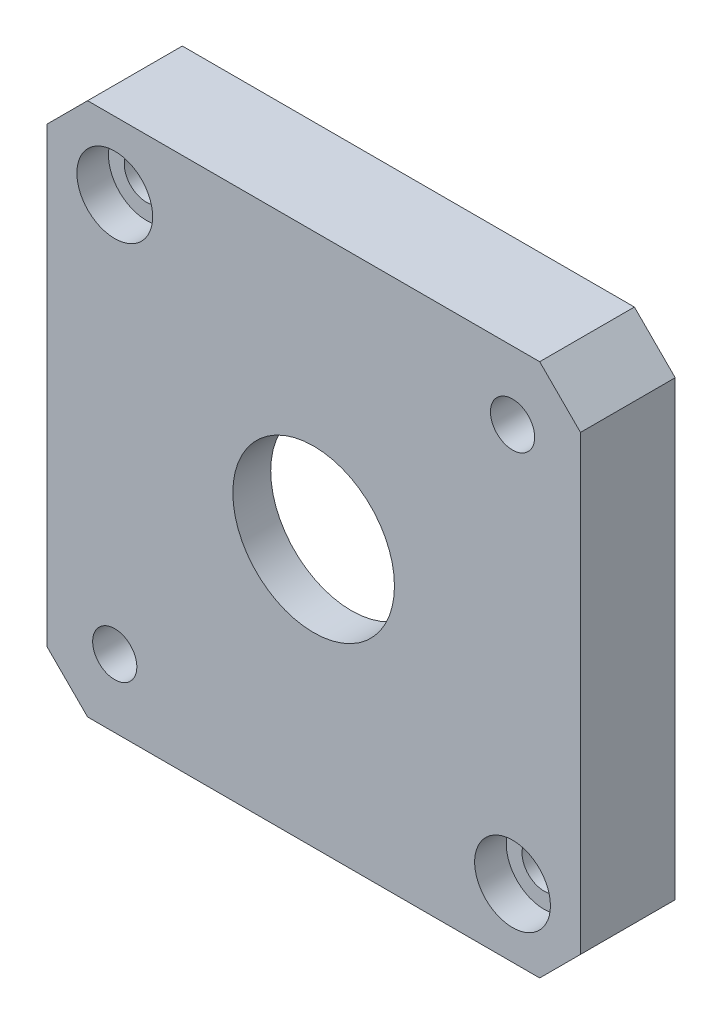
ISO-10303-21;
HEADER;
FILE_DESCRIPTION(('STEP AP214'),'2;1');
FILE_NAME('part.step','',(''),(''),'','','');
FILE_SCHEMA(('AUTOMOTIVE_DESIGN { 1 0 10303 214 1 1 1 1 }'));
ENDSEC;
DATA;
#1=APPLICATION_CONTEXT('core data for automotive mechanical design processes');
#2=APPLICATION_PROTOCOL_DEFINITION('international standard','automotive_design',2000,#1);
#3=PRODUCT_CONTEXT('',#1,'mechanical');
#4=PRODUCT('Part','Part','',(#3));
#5=PRODUCT_RELATED_PRODUCT_CATEGORY('part','',(#4));
#6=PRODUCT_DEFINITION_FORMATION('','',#4);
#7=PRODUCT_DEFINITION_CONTEXT('part definition',#1,'design');
#8=PRODUCT_DEFINITION('design','',#6,#7);
#9=PRODUCT_DEFINITION_SHAPE('','',#8);
#10=(LENGTH_UNIT() NAMED_UNIT(*) SI_UNIT(.MILLI.,.METRE.));
#11=(NAMED_UNIT(*) PLANE_ANGLE_UNIT() SI_UNIT($,.RADIAN.));
#12=(NAMED_UNIT(*) SI_UNIT($,.STERADIAN.) SOLID_ANGLE_UNIT());
#13=UNCERTAINTY_MEASURE_WITH_UNIT(LENGTH_MEASURE(1.E-05),#10,'distance_accuracy_value','');
#14=(GEOMETRIC_REPRESENTATION_CONTEXT(3) GLOBAL_UNCERTAINTY_ASSIGNED_CONTEXT((#13)) GLOBAL_UNIT_ASSIGNED_CONTEXT((#10,
#11,#12)) REPRESENTATION_CONTEXT('',''));
#15=CARTESIAN_POINT('',(0.,0.,0.));
#16=DIRECTION('',(0.,0.,1.));
#17=DIRECTION('',(1.,0.,0.));
#18=AXIS2_PLACEMENT_3D('',#15,#16,#17);
#19=CARTESIAN_POINT('',(-6.94516928509075,15.4665624778803,4.5));
#20=DIRECTION('',(0.,0.,-1.));
#21=DIRECTION('',(-1.,0.,0.));
#22=AXIS2_PLACEMENT_3D('',#19,#20,#21);
#23=CYLINDRICAL_SURFACE('',#22,1.75);
#24=CARTESIAN_POINT('',(-6.94516928509075,15.4665624778803,0.));
#25=DIRECTION('',(0.,0.,1.));
#26=DIRECTION('',(1.,0.,0.));
#27=AXIS2_PLACEMENT_3D('',#24,#25,#26);
#28=CIRCLE('',#27,1.75);
#29=CARTESIAN_POINT('',(-5.19516928509074,15.4665624778803,0.));
#30=VERTEX_POINT('',#29);
#31=EDGE_CURVE('E155',#30,#30,#28,.T.);
#32=ORIENTED_EDGE('',*,*,#31,.F.);
#33=EDGE_LOOP('',(#32));
#34=FACE_BOUND('',#33,.T.);
#35=CARTESIAN_POINT('',(-6.94516928509075,15.4665624778803,5.));
#36=DIRECTION('',(0.,0.,1.));
#37=DIRECTION('',(1.,0.,0.));
#38=AXIS2_PLACEMENT_3D('',#35,#36,#37);
#39=CIRCLE('',#38,1.75);
#40=CARTESIAN_POINT('',(-5.19516928509074,15.4665624778803,5.));
#41=VERTEX_POINT('',#40);
#42=EDGE_CURVE('E37',#41,#41,#39,.T.);
#43=ORIENTED_EDGE('',*,*,#42,.T.);
#44=EDGE_LOOP('',(#43));
#45=FACE_BOUND('',#44,.T.);
#46=ADVANCED_FACE('F33',(#34,#45),#23,.F.);
#47=CARTESIAN_POINT('',(24.5548307149093,-16.0334375221197,4.5));
#48=DIRECTION('',(0.,0.,-1.));
#49=DIRECTION('',(-1.,0.,0.));
#50=AXIS2_PLACEMENT_3D('',#47,#48,#49);
#51=CYLINDRICAL_SURFACE('',#50,1.74999999999999);
#52=CARTESIAN_POINT('',(24.5548307149093,-16.0334375221197,0.));
#53=DIRECTION('',(0.,0.,1.));
#54=DIRECTION('',(1.,0.,0.));
#55=AXIS2_PLACEMENT_3D('',#52,#53,#54);
#56=CIRCLE('',#55,1.74999999999999);
#57=CARTESIAN_POINT('',(26.3048307149092,-16.0334375221197,0.));
#58=VERTEX_POINT('',#57);
#59=EDGE_CURVE('E149',#58,#58,#56,.T.);
#60=ORIENTED_EDGE('',*,*,#59,.F.);
#61=EDGE_LOOP('',(#60));
#62=FACE_BOUND('',#61,.T.);
#63=CARTESIAN_POINT('',(24.5548307149093,-16.0334375221197,5.));
#64=DIRECTION('',(0.,0.,1.));
#65=DIRECTION('',(1.,0.,0.));
#66=AXIS2_PLACEMENT_3D('',#63,#64,#65);
#67=CIRCLE('',#66,1.74999999999999);
#68=CARTESIAN_POINT('',(26.3048307149092,-16.0334375221197,5.));
#69=VERTEX_POINT('',#68);
#70=EDGE_CURVE('E189',#69,#69,#67,.T.);
#71=ORIENTED_EDGE('',*,*,#70,.T.);
#72=EDGE_LOOP('',(#71));
#73=FACE_BOUND('',#72,.T.);
#74=ADVANCED_FACE('F237',(#62,#73),#51,.F.);
#75=CARTESIAN_POINT('',(0.,0.,0.));
#76=DIRECTION('',(0.,0.,1.));
#77=DIRECTION('',(1.,0.,0.));
#78=AXIS2_PLACEMENT_3D('',#75,#76,#77);
#79=PLANE('',#78);
#80=DIRECTION('',(-0.707106781186548,-0.707106781186548,0.));
#81=VECTOR('',#80,1.);
#82=CARTESIAN_POINT('',(-9.09516928509077,20.8488567993777,0.));
#83=LINE('',#82,#81);
#84=CARTESIAN_POINT('',(-9.09516928509077,20.8488567993777,0.));
#85=VERTEX_POINT('',#84);
#86=CARTESIAN_POINT('',(-12.3274636065882,17.6165624778803,0.));
#87=VERTEX_POINT('',#86);
#88=EDGE_CURVE('E163',#85,#87,#83,.T.);
#89=ORIENTED_EDGE('',*,*,#88,.F.);
#90=DIRECTION('',(-1.,0.,0.));
#91=VECTOR('',#90,1.);
#92=CARTESIAN_POINT('',(26.7048307149092,20.8488567993777,0.));
#93=LINE('',#92,#91);
#94=CARTESIAN_POINT('',(26.7048307149092,20.8488567993777,0.));
#95=VERTEX_POINT('',#94);
#96=EDGE_CURVE('E50',#95,#85,#93,.T.);
#97=ORIENTED_EDGE('',*,*,#96,.F.);
#98=DIRECTION('',(-0.707106781186548,0.707106781186547,0.));
#99=VECTOR('',#98,1.);
#100=CARTESIAN_POINT('',(29.9371250364067,17.6165624778803,0.));
#101=LINE('',#100,#99);
#102=CARTESIAN_POINT('',(29.9371250364067,17.6165624778803,0.));
#103=VERTEX_POINT('',#102);
#104=EDGE_CURVE('E58',#103,#95,#101,.T.);
#105=ORIENTED_EDGE('',*,*,#104,.F.);
#106=DIRECTION('',(0.,1.,0.));
#107=VECTOR('',#106,1.);
#108=CARTESIAN_POINT('',(29.9371250364067,-18.1834375221197,0.));
#109=LINE('',#108,#107);
#110=CARTESIAN_POINT('',(29.9371250364067,-18.1834375221197,0.));
#111=VERTEX_POINT('',#110);
#112=EDGE_CURVE('E173',#111,#103,#109,.T.);
#113=ORIENTED_EDGE('',*,*,#112,.F.);
#114=DIRECTION('',(0.707106781186547,0.707106781186547,0.));
#115=VECTOR('',#114,1.);
#116=CARTESIAN_POINT('',(26.7048307149092,-21.4157318436171,0.));
#117=LINE('',#116,#115);
#118=CARTESIAN_POINT('',(26.7048307149092,-21.4157318436171,0.));
#119=VERTEX_POINT('',#118);
#120=EDGE_CURVE('E171',#119,#111,#117,.T.);
#121=ORIENTED_EDGE('',*,*,#120,.F.);
#122=DIRECTION('',(1.,0.,0.));
#123=VECTOR('',#122,1.);
#124=CARTESIAN_POINT('',(-9.09516928509078,-21.4157318436171,0.));
#125=LINE('',#124,#123);
#126=CARTESIAN_POINT('',(-9.09516928509078,-21.4157318436171,0.));
#127=VERTEX_POINT('',#126);
#128=EDGE_CURVE('E169',#127,#119,#125,.T.);
#129=ORIENTED_EDGE('',*,*,#128,.F.);
#130=DIRECTION('',(0.707106781186547,-0.707106781186547,0.));
#131=VECTOR('',#130,1.);
#132=CARTESIAN_POINT('',(-12.3274636065882,-18.1834375221197,0.));
#133=LINE('',#132,#131);
#134=CARTESIAN_POINT('',(-12.3274636065882,-18.1834375221197,0.));
#135=VERTEX_POINT('',#134);
#136=EDGE_CURVE('E167',#135,#127,#133,.T.);
#137=ORIENTED_EDGE('',*,*,#136,.F.);
#138=DIRECTION('',(0.,-1.,0.));
#139=VECTOR('',#138,1.);
#140=CARTESIAN_POINT('',(-12.3274636065882,17.6165624778803,0.));
#141=LINE('',#140,#139);
#142=EDGE_CURVE('E105',#87,#135,#141,.T.);
#143=ORIENTED_EDGE('',*,*,#142,.F.);
#144=EDGE_LOOP('',(#89,#97,#105,#113,#121,#129,#137,#143));
#145=FACE_BOUND('',#144,.T.);
#146=CARTESIAN_POINT('',(8.80483071490925,-0.283437522119711,0.));
#147=DIRECTION('',(0.,0.,1.));
#148=DIRECTION('',(1.,0.,0.));
#149=AXIS2_PLACEMENT_3D('',#146,#147,#148);
#150=CIRCLE('',#149,18.5);
#151=CARTESIAN_POINT('',(27.3048307149093,-0.283437522119711,0.));
#152=VERTEX_POINT('',#151);
#153=EDGE_CURVE('E158',#152,#152,#150,.T.);
#154=ORIENTED_EDGE('',*,*,#153,.T.);
#155=EDGE_LOOP('',(#154));
#156=FACE_BOUND('',#155,.T.);
#157=ORIENTED_EDGE('',*,*,#31,.T.);
#158=EDGE_LOOP('',(#157));
#159=FACE_BOUND('',#158,.T.);
#160=CARTESIAN_POINT('',(-6.94516928509075,-16.0334375221197,0.));
#161=DIRECTION('',(0.,0.,1.));
#162=DIRECTION('',(1.,0.,0.));
#163=AXIS2_PLACEMENT_3D('',#160,#161,#162);
#164=CIRCLE('',#163,1.75);
#165=CARTESIAN_POINT('',(-5.19516928509074,-16.0334375221197,0.));
#166=VERTEX_POINT('',#165);
#167=EDGE_CURVE('E152',#166,#166,#164,.T.);
#168=ORIENTED_EDGE('',*,*,#167,.T.);
#169=EDGE_LOOP('',(#168));
#170=FACE_BOUND('',#169,.T.);
#171=ORIENTED_EDGE('',*,*,#59,.T.);
#172=EDGE_LOOP('',(#171));
#173=FACE_BOUND('',#172,.T.);
#174=CARTESIAN_POINT('',(24.5548307149093,15.4665624778803,0.));
#175=DIRECTION('',(0.,0.,1.));
#176=DIRECTION('',(1.,0.,0.));
#177=AXIS2_PLACEMENT_3D('',#174,#175,#176);
#178=CIRCLE('',#177,1.75000000000075);
#179=CARTESIAN_POINT('',(26.30483071491,15.4665624778803,0.));
#180=VERTEX_POINT('',#179);
#181=EDGE_CURVE('E146',#180,#180,#178,.T.);
#182=ORIENTED_EDGE('',*,*,#181,.T.);
#183=EDGE_LOOP('',(#182));
#184=FACE_BOUND('',#183,.T.);
#185=ADVANCED_FACE('F243',(#145,#156,#159,#170,#173,#184),#79,.F.);
#186=CARTESIAN_POINT('',(-9.09516928509077,20.8488567993777,4.5));
#187=DIRECTION('',(0.707106781186548,-0.707106781186548,0.));
#188=DIRECTION('',(0.707106781186548,0.707106781186548,0.));
#189=AXIS2_PLACEMENT_3D('',#186,#187,#188);
#190=PLANE('',#189);
#191=ORIENTED_EDGE('',*,*,#88,.T.);
#192=DIRECTION('',(0.,0.,-1.));
#193=VECTOR('',#192,1.);
#194=CARTESIAN_POINT('',(-12.3274636065882,17.6165624778803,4.5));
#195=LINE('',#194,#193);
#196=CARTESIAN_POINT('',(-12.3274636065882,17.6165624778803,7.5));
#197=VERTEX_POINT('',#196);
#198=EDGE_CURVE('E11',#197,#87,#195,.T.);
#199=ORIENTED_EDGE('',*,*,#198,.F.);
#200=DIRECTION('',(-0.707106781186548,-0.707106781186548,0.));
#201=VECTOR('',#200,1.);
#202=CARTESIAN_POINT('',(-12.3274636065882,17.6165624778803,7.5));
#203=LINE('',#202,#201);
#204=CARTESIAN_POINT('',(-9.09516928509077,20.8488567993777,7.5));
#205=VERTEX_POINT('',#204);
#206=EDGE_CURVE('E124',#205,#197,#203,.T.);
#207=ORIENTED_EDGE('',*,*,#206,.F.);
#208=DIRECTION('',(0.,0.,-1.));
#209=VECTOR('',#208,1.);
#210=CARTESIAN_POINT('',(-9.09516928509077,20.8488567993777,4.5));
#211=LINE('',#210,#209);
#212=EDGE_CURVE('E177',#205,#85,#211,.T.);
#213=ORIENTED_EDGE('',*,*,#212,.T.);
#214=EDGE_LOOP('',(#191,#199,#207,#213));
#215=FACE_BOUND('',#214,.T.);
#216=ADVANCED_FACE('F35',(#215),#190,.F.);
#217=CARTESIAN_POINT('',(-12.3274636065882,17.6165624778803,4.5));
#218=DIRECTION('',(1.,0.,0.));
#219=DIRECTION('',(0.,0.,-1.));
#220=AXIS2_PLACEMENT_3D('',#217,#218,#219);
#221=PLANE('',#220);
#222=ORIENTED_EDGE('',*,*,#142,.T.);
#223=DIRECTION('',(0.,0.,-1.));
#224=VECTOR('',#223,1.);
#225=CARTESIAN_POINT('',(-12.3274636065882,-18.1834375221197,4.5));
#226=LINE('',#225,#224);
#227=CARTESIAN_POINT('',(-12.3274636065882,-18.1834375221197,7.5));
#228=VERTEX_POINT('',#227);
#229=EDGE_CURVE('E42',#228,#135,#226,.T.);
#230=ORIENTED_EDGE('',*,*,#229,.F.);
#231=DIRECTION('',(0.,-1.,0.));
#232=VECTOR('',#231,1.);
#233=CARTESIAN_POINT('',(-12.3274636065882,-18.1834375221197,7.5));
#234=LINE('',#233,#232);
#235=EDGE_CURVE('E104',#197,#228,#234,.T.);
#236=ORIENTED_EDGE('',*,*,#235,.F.);
#237=ORIENTED_EDGE('',*,*,#198,.T.);
#238=EDGE_LOOP('',(#222,#230,#236,#237));
#239=FACE_BOUND('',#238,.T.);
#240=ADVANCED_FACE('F102',(#239),#221,.F.);
#241=CARTESIAN_POINT('',(-12.3274636065882,-18.1834375221197,4.5));
#242=DIRECTION('',(0.707106781186547,0.707106781186547,0.));
#243=DIRECTION('',(-0.707106781186548,0.707106781186548,0.));
#244=AXIS2_PLACEMENT_3D('',#241,#242,#243);
#245=PLANE('',#244);
#246=ORIENTED_EDGE('',*,*,#136,.T.);
#247=DIRECTION('',(0.,0.,-1.));
#248=VECTOR('',#247,1.);
#249=CARTESIAN_POINT('',(-9.09516928509078,-21.4157318436171,4.5));
#250=LINE('',#249,#248);
#251=CARTESIAN_POINT('',(-9.09516928509078,-21.4157318436171,7.5));
#252=VERTEX_POINT('',#251);
#253=EDGE_CURVE('E108',#252,#127,#250,.T.);
#254=ORIENTED_EDGE('',*,*,#253,.F.);
#255=DIRECTION('',(0.707106781186547,-0.707106781186547,0.));
#256=VECTOR('',#255,1.);
#257=CARTESIAN_POINT('',(-9.09516928509078,-21.4157318436171,7.5));
#258=LINE('',#257,#256);
#259=EDGE_CURVE('E111',#228,#252,#258,.T.);
#260=ORIENTED_EDGE('',*,*,#259,.F.);
#261=ORIENTED_EDGE('',*,*,#229,.T.);
#262=EDGE_LOOP('',(#246,#254,#260,#261));
#263=FACE_BOUND('',#262,.T.);
#264=ADVANCED_FACE('F112',(#263),#245,.F.);
#265=CARTESIAN_POINT('',(-9.09516928509078,-21.4157318436171,4.5));
#266=DIRECTION('',(0.,1.,0.));
#267=DIRECTION('',(0.,0.,1.));
#268=AXIS2_PLACEMENT_3D('',#265,#266,#267);
#269=PLANE('',#268);
#270=ORIENTED_EDGE('',*,*,#128,.T.);
#271=DIRECTION('',(0.,0.,-1.));
#272=VECTOR('',#271,1.);
#273=CARTESIAN_POINT('',(26.7048307149092,-21.4157318436171,4.5));
#274=LINE('',#273,#272);
#275=CARTESIAN_POINT('',(26.7048307149092,-21.4157318436171,7.5));
#276=VERTEX_POINT('',#275);
#277=EDGE_CURVE('E186',#276,#119,#274,.T.);
#278=ORIENTED_EDGE('',*,*,#277,.F.);
#279=DIRECTION('',(1.,0.,0.));
#280=VECTOR('',#279,1.);
#281=CARTESIAN_POINT('',(26.7048307149092,-21.4157318436171,7.5));
#282=LINE('',#281,#280);
#283=EDGE_CURVE('E117',#252,#276,#282,.T.);
#284=ORIENTED_EDGE('',*,*,#283,.F.);
#285=ORIENTED_EDGE('',*,*,#253,.T.);
#286=EDGE_LOOP('',(#270,#278,#284,#285));
#287=FACE_BOUND('',#286,.T.);
#288=ADVANCED_FACE('F271',(#287),#269,.F.);
#289=CARTESIAN_POINT('',(26.7048307149092,-21.4157318436171,4.5));
#290=DIRECTION('',(-0.707106781186547,0.707106781186547,0.));
#291=DIRECTION('',(-0.707106781186548,-0.707106781186548,0.));
#292=AXIS2_PLACEMENT_3D('',#289,#290,#291);
#293=PLANE('',#292);
#294=ORIENTED_EDGE('',*,*,#120,.T.);
#295=DIRECTION('',(0.,0.,-1.));
#296=VECTOR('',#295,1.);
#297=CARTESIAN_POINT('',(29.9371250364067,-18.1834375221197,4.5));
#298=LINE('',#297,#296);
#299=CARTESIAN_POINT('',(29.9371250364067,-18.1834375221197,7.5));
#300=VERTEX_POINT('',#299);
#301=EDGE_CURVE('E183',#300,#111,#298,.T.);
#302=ORIENTED_EDGE('',*,*,#301,.F.);
#303=DIRECTION('',(0.707106781186547,0.707106781186547,0.));
#304=VECTOR('',#303,1.);
#305=CARTESIAN_POINT('',(29.9371250364067,-18.1834375221197,7.5));
#306=LINE('',#305,#304);
#307=EDGE_CURVE('E133',#276,#300,#306,.T.);
#308=ORIENTED_EDGE('',*,*,#307,.F.);
#309=ORIENTED_EDGE('',*,*,#277,.T.);
#310=EDGE_LOOP('',(#294,#302,#308,#309));
#311=FACE_BOUND('',#310,.T.);
#312=ADVANCED_FACE('F267',(#311),#293,.F.);
#313=CARTESIAN_POINT('',(29.9371250364067,-18.1834375221197,4.5));
#314=DIRECTION('',(-1.,0.,0.));
#315=DIRECTION('',(0.,0.,1.));
#316=AXIS2_PLACEMENT_3D('',#313,#314,#315);
#317=PLANE('',#316);
#318=ORIENTED_EDGE('',*,*,#112,.T.);
#319=DIRECTION('',(0.,0.,-1.));
#320=VECTOR('',#319,1.);
#321=CARTESIAN_POINT('',(29.9371250364067,17.6165624778803,4.5));
#322=LINE('',#321,#320);
#323=CARTESIAN_POINT('',(29.9371250364067,17.6165624778803,7.5));
#324=VERTEX_POINT('',#323);
#325=EDGE_CURVE('E181',#324,#103,#322,.T.);
#326=ORIENTED_EDGE('',*,*,#325,.F.);
#327=DIRECTION('',(0.,1.,0.));
#328=VECTOR('',#327,1.);
#329=CARTESIAN_POINT('',(29.9371250364067,17.6165624778803,7.5));
#330=LINE('',#329,#328);
#331=EDGE_CURVE('E136',#300,#324,#330,.T.);
#332=ORIENTED_EDGE('',*,*,#331,.F.);
#333=ORIENTED_EDGE('',*,*,#301,.T.);
#334=EDGE_LOOP('',(#318,#326,#332,#333));
#335=FACE_BOUND('',#334,.T.);
#336=ADVANCED_FACE('F264',(#335),#317,.F.);
#337=CARTESIAN_POINT('',(29.9371250364067,17.6165624778803,4.5));
#338=DIRECTION('',(-0.707106781186547,-0.707106781186548,0.));
#339=DIRECTION('',(0.707106781186548,-0.707106781186547,0.));
#340=AXIS2_PLACEMENT_3D('',#337,#338,#339);
#341=PLANE('',#340);
#342=ORIENTED_EDGE('',*,*,#104,.T.);
#343=DIRECTION('',(0.,0.,-1.));
#344=VECTOR('',#343,1.);
#345=CARTESIAN_POINT('',(26.7048307149092,20.8488567993777,4.5));
#346=LINE('',#345,#344);
#347=CARTESIAN_POINT('',(26.7048307149092,20.8488567993777,7.5));
#348=VERTEX_POINT('',#347);
#349=EDGE_CURVE('E179',#348,#95,#346,.T.);
#350=ORIENTED_EDGE('',*,*,#349,.F.);
#351=DIRECTION('',(-0.707106781186548,0.707106781186547,0.));
#352=VECTOR('',#351,1.);
#353=CARTESIAN_POINT('',(26.7048307149092,20.8488567993777,7.5));
#354=LINE('',#353,#352);
#355=EDGE_CURVE('E139',#324,#348,#354,.T.);
#356=ORIENTED_EDGE('',*,*,#355,.F.);
#357=ORIENTED_EDGE('',*,*,#325,.T.);
#358=EDGE_LOOP('',(#342,#350,#356,#357));
#359=FACE_BOUND('',#358,.T.);
#360=ADVANCED_FACE('F261',(#359),#341,.F.);
#361=CARTESIAN_POINT('',(26.7048307149092,20.8488567993777,4.5));
#362=DIRECTION('',(0.,-1.,0.));
#363=DIRECTION('',(0.,0.,-1.));
#364=AXIS2_PLACEMENT_3D('',#361,#362,#363);
#365=PLANE('',#364);
#366=ORIENTED_EDGE('',*,*,#96,.T.);
#367=ORIENTED_EDGE('',*,*,#212,.F.);
#368=DIRECTION('',(-1.,0.,0.));
#369=VECTOR('',#368,1.);
#370=CARTESIAN_POINT('',(-9.09516928509077,20.8488567993777,7.5));
#371=LINE('',#370,#369);
#372=EDGE_CURVE('E142',#348,#205,#371,.T.);
#373=ORIENTED_EDGE('',*,*,#372,.F.);
#374=ORIENTED_EDGE('',*,*,#349,.T.);
#375=EDGE_LOOP('',(#366,#367,#373,#374));
#376=FACE_BOUND('',#375,.T.);
#377=ADVANCED_FACE('F254',(#376),#365,.F.);
#378=CARTESIAN_POINT('',(8.80483071490925,-0.283437522119711,4.5));
#379=DIRECTION('',(0.,0.,-1.));
#380=DIRECTION('',(-1.,0.,0.));
#381=AXIS2_PLACEMENT_3D('',#378,#379,#380);
#382=CYLINDRICAL_SURFACE('',#381,18.5);
#383=CARTESIAN_POINT('',(8.80483071490925,-0.283437522119711,4.5));
#384=DIRECTION('',(0.,0.,1.));
#385=DIRECTION('',(1.,0.,0.));
#386=AXIS2_PLACEMENT_3D('',#383,#384,#385);
#387=CIRCLE('',#386,18.5);
#388=CARTESIAN_POINT('',(27.3048307149093,-0.283437522119711,4.5));
#389=VERTEX_POINT('',#388);
#390=EDGE_CURVE('E145',#389,#389,#387,.T.);
#391=ORIENTED_EDGE('',*,*,#390,.T.);
#392=EDGE_LOOP('',(#391));
#393=FACE_BOUND('',#392,.T.);
#394=ORIENTED_EDGE('',*,*,#153,.F.);
#395=EDGE_LOOP('',(#394));
#396=FACE_BOUND('',#395,.T.);
#397=ADVANCED_FACE('F251',(#393,#396),#382,.F.);
#398=CARTESIAN_POINT('',(-6.94516928509075,-16.0334375221197,4.5));
#399=DIRECTION('',(0.,0.,-1.));
#400=DIRECTION('',(-1.,0.,0.));
#401=AXIS2_PLACEMENT_3D('',#398,#399,#400);
#402=CYLINDRICAL_SURFACE('',#401,1.75);
#403=ORIENTED_EDGE('',*,*,#167,.F.);
#404=EDGE_LOOP('',(#403));
#405=FACE_BOUND('',#404,.T.);
#406=CARTESIAN_POINT('',(-6.94516928509075,-16.0334375221197,7.5));
#407=DIRECTION('',(0.,0.,1.));
#408=DIRECTION('',(1.,0.,0.));
#409=AXIS2_PLACEMENT_3D('',#406,#407,#408);
#410=CIRCLE('',#409,1.75);
#411=CARTESIAN_POINT('',(-5.19516928509074,-16.0334375221197,7.5));
#412=VERTEX_POINT('',#411);
#413=EDGE_CURVE('E195',#412,#412,#410,.T.);
#414=ORIENTED_EDGE('',*,*,#413,.T.);
#415=EDGE_LOOP('',(#414));
#416=FACE_BOUND('',#415,.T.);
#417=ADVANCED_FACE('F250',(#405,#416),#402,.F.);
#418=CARTESIAN_POINT('',(24.5548307149093,15.4665624778803,4.5));
#419=DIRECTION('',(0.,0.,-1.));
#420=DIRECTION('',(-1.,0.,0.));
#421=AXIS2_PLACEMENT_3D('',#418,#419,#420);
#422=CYLINDRICAL_SURFACE('',#421,1.75000000000075);
#423=ORIENTED_EDGE('',*,*,#181,.F.);
#424=EDGE_LOOP('',(#423));
#425=FACE_BOUND('',#424,.T.);
#426=CARTESIAN_POINT('',(24.5548307149093,15.4665624778803,7.5));
#427=DIRECTION('',(0.,0.,1.));
#428=DIRECTION('',(1.,0.,0.));
#429=AXIS2_PLACEMENT_3D('',#426,#427,#428);
#430=CIRCLE('',#429,1.75000000000023);
#431=CARTESIAN_POINT('',(26.3048307149095,15.4665624778803,7.5));
#432=VERTEX_POINT('',#431);
#433=EDGE_CURVE('E212',#432,#432,#430,.T.);
#434=ORIENTED_EDGE('',*,*,#433,.T.);
#435=EDGE_LOOP('',(#434));
#436=FACE_BOUND('',#435,.T.);
#437=ADVANCED_FACE('F302',(#425,#436),#422,.F.);
#438=CARTESIAN_POINT('',(0.,0.,4.5));
#439=DIRECTION('',(0.,0.,-1.));
#440=DIRECTION('',(-1.,0.,0.));
#441=AXIS2_PLACEMENT_3D('',#438,#439,#440);
#442=PLANE('',#441);
#443=CARTESIAN_POINT('',(8.80483071490925,-0.28343752211971,4.5));
#444=DIRECTION('',(0.,0.,1.));
#445=DIRECTION('',(1.,0.,0.));
#446=AXIS2_PLACEMENT_3D('',#443,#444,#445);
#447=CIRCLE('',#446,6.4);
#448=CARTESIAN_POINT('',(15.2048307149093,-0.28343752211971,4.5));
#449=VERTEX_POINT('',#448);
#450=EDGE_CURVE('E128',#449,#449,#447,.T.);
#451=ORIENTED_EDGE('',*,*,#450,.T.);
#452=EDGE_LOOP('',(#451));
#453=FACE_BOUND('',#452,.T.);
#454=ORIENTED_EDGE('',*,*,#390,.F.);
#455=EDGE_LOOP('',(#454));
#456=FACE_BOUND('',#455,.T.);
#457=ADVANCED_FACE('F219',(#453,#456),#442,.T.);
#458=CARTESIAN_POINT('',(0.,0.,7.5));
#459=DIRECTION('',(0.,0.,-1.));
#460=DIRECTION('',(-1.,0.,0.));
#461=AXIS2_PLACEMENT_3D('',#458,#459,#460);
#462=PLANE('',#461);
#463=CARTESIAN_POINT('',(-6.94516928509075,15.4665624778803,7.5));
#464=DIRECTION('',(0.,0.,1.));
#465=DIRECTION('',(1.,0.,0.));
#466=AXIS2_PLACEMENT_3D('',#463,#464,#465);
#467=CIRCLE('',#466,3.);
#468=CARTESIAN_POINT('',(-3.94516928509075,15.4665624778803,7.5));
#469=VERTEX_POINT('',#468);
#470=EDGE_CURVE('E197',#469,#469,#467,.T.);
#471=ORIENTED_EDGE('',*,*,#470,.F.);
#472=EDGE_LOOP('',(#471));
#473=FACE_BOUND('',#472,.T.);
#474=CARTESIAN_POINT('',(24.5548307149093,-16.0334375221197,7.5));
#475=DIRECTION('',(0.,0.,1.));
#476=DIRECTION('',(1.,0.,0.));
#477=AXIS2_PLACEMENT_3D('',#474,#475,#476);
#478=CIRCLE('',#477,3.);
#479=CARTESIAN_POINT('',(27.5548307149093,-16.0334375221197,7.5));
#480=VERTEX_POINT('',#479);
#481=EDGE_CURVE('E207',#480,#480,#478,.T.);
#482=ORIENTED_EDGE('',*,*,#481,.F.);
#483=EDGE_LOOP('',(#482));
#484=FACE_BOUND('',#483,.T.);
#485=ORIENTED_EDGE('',*,*,#235,.T.);
#486=ORIENTED_EDGE('',*,*,#259,.T.);
#487=ORIENTED_EDGE('',*,*,#283,.T.);
#488=ORIENTED_EDGE('',*,*,#307,.T.);
#489=ORIENTED_EDGE('',*,*,#331,.T.);
#490=ORIENTED_EDGE('',*,*,#355,.T.);
#491=ORIENTED_EDGE('',*,*,#372,.T.);
#492=ORIENTED_EDGE('',*,*,#206,.T.);
#493=EDGE_LOOP('',(#485,#486,#487,#488,#489,#490,#491,#492));
#494=FACE_BOUND('',#493,.T.);
#495=CARTESIAN_POINT('',(8.80483071490925,-0.28343752211971,7.5));
#496=DIRECTION('',(0.,0.,1.));
#497=DIRECTION('',(1.,0.,0.));
#498=AXIS2_PLACEMENT_3D('',#495,#496,#497);
#499=CIRCLE('',#498,6.4);
#500=CARTESIAN_POINT('',(15.2048307149093,-0.28343752211971,7.5));
#501=VERTEX_POINT('',#500);
#502=EDGE_CURVE('E125',#501,#501,#499,.T.);
#503=ORIENTED_EDGE('',*,*,#502,.F.);
#504=EDGE_LOOP('',(#503));
#505=FACE_BOUND('',#504,.T.);
#506=ORIENTED_EDGE('',*,*,#433,.F.);
#507=EDGE_LOOP('',(#506));
#508=FACE_BOUND('',#507,.T.);
#509=ORIENTED_EDGE('',*,*,#413,.F.);
#510=EDGE_LOOP('',(#509));
#511=FACE_BOUND('',#510,.T.);
#512=ADVANCED_FACE('F120',(#473,#484,#494,#505,#508,#511),#462,.F.);
#513=CARTESIAN_POINT('',(8.80483071490925,-0.28343752211971,7.5));
#514=DIRECTION('',(0.,0.,-1.));
#515=DIRECTION('',(-1.,0.,0.));
#516=AXIS2_PLACEMENT_3D('',#513,#514,#515);
#517=CYLINDRICAL_SURFACE('',#516,6.4);
#518=ORIENTED_EDGE('',*,*,#502,.T.);
#519=EDGE_LOOP('',(#518));
#520=FACE_BOUND('',#519,.T.);
#521=ORIENTED_EDGE('',*,*,#450,.F.);
#522=EDGE_LOOP('',(#521));
#523=FACE_BOUND('',#522,.T.);
#524=ADVANCED_FACE('F222',(#520,#523),#517,.F.);
#525=CARTESIAN_POINT('',(24.5548307149093,-16.0334375221197,5.));
#526=DIRECTION('',(0.,0.,1.));
#527=DIRECTION('',(1.,0.,0.));
#528=AXIS2_PLACEMENT_3D('',#525,#526,#527);
#529=CYLINDRICAL_SURFACE('',#528,3.);
#530=CARTESIAN_POINT('',(24.5548307149093,-16.0334375221197,5.));
#531=DIRECTION('',(0.,0.,1.));
#532=DIRECTION('',(1.,0.,0.));
#533=AXIS2_PLACEMENT_3D('',#530,#531,#532);
#534=CIRCLE('',#533,3.);
#535=CARTESIAN_POINT('',(27.5548307149093,-16.0334375221197,5.));
#536=VERTEX_POINT('',#535);
#537=EDGE_CURVE('E202',#536,#536,#534,.T.);
#538=ORIENTED_EDGE('',*,*,#537,.F.);
#539=EDGE_LOOP('',(#538));
#540=FACE_BOUND('',#539,.T.);
#541=ORIENTED_EDGE('',*,*,#481,.T.);
#542=EDGE_LOOP('',(#541));
#543=FACE_BOUND('',#542,.T.);
#544=ADVANCED_FACE('F224',(#540,#543),#529,.F.);
#545=CARTESIAN_POINT('',(24.5548307149093,-16.0334375221197,5.));
#546=DIRECTION('',(0.,0.,1.));
#547=DIRECTION('',(1.,0.,0.));
#548=AXIS2_PLACEMENT_3D('',#545,#546,#547);
#549=PLANE('',#548);
#550=ORIENTED_EDGE('',*,*,#70,.F.);
#551=EDGE_LOOP('',(#550));
#552=FACE_BOUND('',#551,.T.);
#553=ORIENTED_EDGE('',*,*,#537,.T.);
#554=EDGE_LOOP('',(#553));
#555=FACE_BOUND('',#554,.T.);
#556=ADVANCED_FACE('F231',(#552,#555),#549,.T.);
#557=CARTESIAN_POINT('',(-6.94516928509075,15.4665624778803,5.));
#558=DIRECTION('',(0.,0.,1.));
#559=DIRECTION('',(1.,0.,0.));
#560=AXIS2_PLACEMENT_3D('',#557,#558,#559);
#561=CYLINDRICAL_SURFACE('',#560,3.);
#562=CARTESIAN_POINT('',(-6.94516928509075,15.4665624778803,5.));
#563=DIRECTION('',(0.,0.,1.));
#564=DIRECTION('',(1.,0.,0.));
#565=AXIS2_PLACEMENT_3D('',#562,#563,#564);
#566=CIRCLE('',#565,3.);
#567=CARTESIAN_POINT('',(-3.94516928509075,15.4665624778803,5.));
#568=VERTEX_POINT('',#567);
#569=EDGE_CURVE('E191',#568,#568,#566,.T.);
#570=ORIENTED_EDGE('',*,*,#569,.F.);
#571=EDGE_LOOP('',(#570));
#572=FACE_BOUND('',#571,.T.);
#573=ORIENTED_EDGE('',*,*,#470,.T.);
#574=EDGE_LOOP('',(#573));
#575=FACE_BOUND('',#574,.T.);
#576=ADVANCED_FACE('F446',(#572,#575),#561,.F.);
#577=CARTESIAN_POINT('',(-6.94516928509075,15.4665624778803,5.));
#578=DIRECTION('',(0.,0.,1.));
#579=DIRECTION('',(1.,0.,0.));
#580=AXIS2_PLACEMENT_3D('',#577,#578,#579);
#581=PLANE('',#580);
#582=ORIENTED_EDGE('',*,*,#42,.F.);
#583=EDGE_LOOP('',(#582));
#584=FACE_BOUND('',#583,.T.);
#585=ORIENTED_EDGE('',*,*,#569,.T.);
#586=EDGE_LOOP('',(#585));
#587=FACE_BOUND('',#586,.T.);
#588=ADVANCED_FACE('F455',(#584,#587),#581,.T.);
#589=CLOSED_SHELL('',(#46,#74,#185,#216,#240,#264,#288,#312,#336,#360,#377,#397,#417,#437,#457,
#512,#524,#544,#556,#576,#588));
#590=MANIFOLD_SOLID_BREP('B2',#589);
#591=ADVANCED_BREP_SHAPE_REPRESENTATION('',(#18,#590),#14);
#592=SHAPE_DEFINITION_REPRESENTATION(#9,#591);
ENDSEC;
END-ISO-10303-21;
